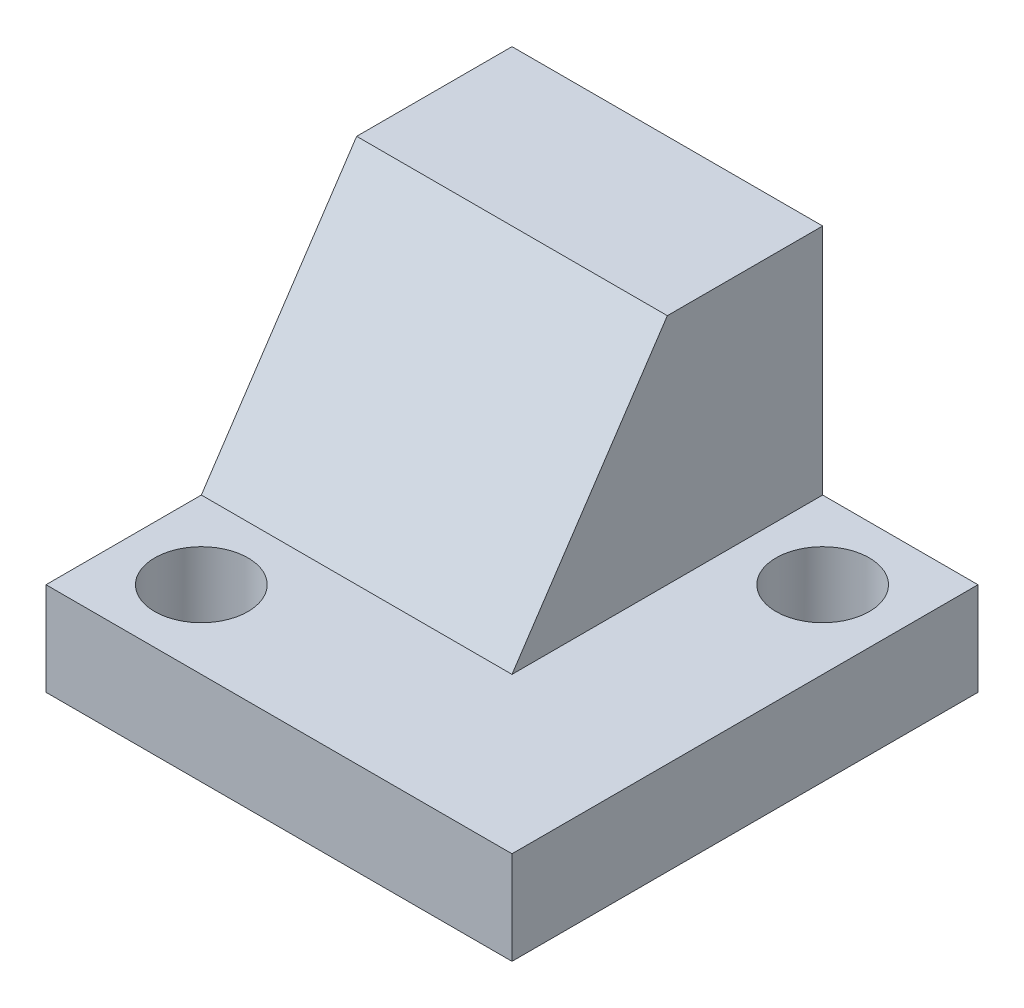
ISO-10303-21;
HEADER;
FILE_DESCRIPTION(('STEP AP214'),'2;1');
FILE_NAME('part.step','',(''),(''),'','','');
FILE_SCHEMA(('AUTOMOTIVE_DESIGN { 1 0 10303 214 1 1 1 1 }'));
ENDSEC;
DATA;
#1=APPLICATION_CONTEXT('core data for automotive mechanical design processes');
#2=APPLICATION_PROTOCOL_DEFINITION('international standard','automotive_design',2000,#1);
#3=PRODUCT_CONTEXT('',#1,'mechanical');
#4=PRODUCT('Part','Part','',(#3));
#5=PRODUCT_RELATED_PRODUCT_CATEGORY('part','',(#4));
#6=PRODUCT_DEFINITION_FORMATION('','',#4);
#7=PRODUCT_DEFINITION_CONTEXT('part definition',#1,'design');
#8=PRODUCT_DEFINITION('design','',#6,#7);
#9=PRODUCT_DEFINITION_SHAPE('','',#8);
#10=(LENGTH_UNIT() NAMED_UNIT(*) SI_UNIT(.MILLI.,.METRE.));
#11=(NAMED_UNIT(*) PLANE_ANGLE_UNIT() SI_UNIT($,.RADIAN.));
#12=(NAMED_UNIT(*) SI_UNIT($,.STERADIAN.) SOLID_ANGLE_UNIT());
#13=UNCERTAINTY_MEASURE_WITH_UNIT(LENGTH_MEASURE(1.E-05),#10,'distance_accuracy_value','');
#14=(GEOMETRIC_REPRESENTATION_CONTEXT(3) GLOBAL_UNCERTAINTY_ASSIGNED_CONTEXT((#13)) GLOBAL_UNIT_ASSIGNED_CONTEXT((#10,
#11,#12)) REPRESENTATION_CONTEXT('',''));
#15=CARTESIAN_POINT('',(0.,0.,0.));
#16=DIRECTION('',(0.,0.,1.));
#17=DIRECTION('',(1.,0.,0.));
#18=AXIS2_PLACEMENT_3D('',#15,#16,#17);
#19=CARTESIAN_POINT('',(0.,7.62,0.));
#20=DIRECTION('',(0.,-1.,0.));
#21=DIRECTION('',(0.,0.,-1.));
#22=AXIS2_PLACEMENT_3D('',#19,#20,#21);
#23=PLANE('',#22);
#24=CARTESIAN_POINT('',(12.7,7.62,-12.7));
#25=DIRECTION('',(0.,1.,0.));
#26=DIRECTION('',(0.,0.,1.));
#27=AXIS2_PLACEMENT_3D('',#24,#25,#26);
#28=CIRCLE('',#27,3.81);
#29=CARTESIAN_POINT('',(12.7,7.62,-8.89));
#30=VERTEX_POINT('',#29);
#31=EDGE_CURVE('E174',#30,#30,#28,.T.);
#32=ORIENTED_EDGE('',*,*,#31,.F.);
#33=EDGE_LOOP('',(#32));
#34=FACE_BOUND('',#33,.T.);
#35=CARTESIAN_POINT('',(-12.7,7.62,12.7));
#36=DIRECTION('',(0.,1.,0.));
#37=DIRECTION('',(0.,0.,1.));
#38=AXIS2_PLACEMENT_3D('',#35,#36,#37);
#39=CIRCLE('',#38,3.81);
#40=CARTESIAN_POINT('',(-12.7,7.62,16.51));
#41=VERTEX_POINT('',#40);
#42=EDGE_CURVE('E303',#41,#41,#39,.T.);
#43=ORIENTED_EDGE('',*,*,#42,.F.);
#44=EDGE_LOOP('',(#43));
#45=FACE_BOUND('',#44,.T.);
#46=DIRECTION('',(0.,0.,-1.));
#47=VECTOR('',#46,1.);
#48=CARTESIAN_POINT('',(6.34999999999999,7.62,6.34999999999999));
#49=LINE('',#48,#47);
#50=CARTESIAN_POINT('',(6.34999999999999,7.62000000000001,6.35));
#51=VERTEX_POINT('',#50);
#52=CARTESIAN_POINT('',(6.34999999999998,7.62,-19.05));
#53=VERTEX_POINT('',#52);
#54=EDGE_CURVE('E158',#51,#53,#49,.T.);
#55=ORIENTED_EDGE('',*,*,#54,.F.);
#56=DIRECTION('',(1.,0.,0.));
#57=VECTOR('',#56,1.);
#58=CARTESIAN_POINT('',(6.34999999999999,7.62,6.34999999999999));
#59=LINE('',#58,#57);
#60=CARTESIAN_POINT('',(-19.05,7.62000000000001,6.35));
#61=VERTEX_POINT('',#60);
#62=EDGE_CURVE('E164',#61,#51,#59,.T.);
#63=ORIENTED_EDGE('',*,*,#62,.F.);
#64=DIRECTION('',(0.,0.,1.));
#65=VECTOR('',#64,1.);
#66=CARTESIAN_POINT('',(-19.05,7.62,19.05));
#67=LINE('',#66,#65);
#68=CARTESIAN_POINT('',(-19.05,7.62,19.05));
#69=VERTEX_POINT('',#68);
#70=EDGE_CURVE('E149',#61,#69,#67,.T.);
#71=ORIENTED_EDGE('',*,*,#70,.T.);
#72=DIRECTION('',(1.,0.,0.));
#73=VECTOR('',#72,1.);
#74=CARTESIAN_POINT('',(-19.05,7.62,19.05));
#75=LINE('',#74,#73);
#76=CARTESIAN_POINT('',(19.05,7.62,19.05));
#77=VERTEX_POINT('',#76);
#78=EDGE_CURVE('E190',#69,#77,#75,.T.);
#79=ORIENTED_EDGE('',*,*,#78,.T.);
#80=DIRECTION('',(0.,0.,-1.));
#81=VECTOR('',#80,1.);
#82=CARTESIAN_POINT('',(19.05,7.62,19.05));
#83=LINE('',#82,#81);
#84=CARTESIAN_POINT('',(19.05,7.62,-19.05));
#85=VERTEX_POINT('',#84);
#86=EDGE_CURVE('E180',#77,#85,#83,.T.);
#87=ORIENTED_EDGE('',*,*,#86,.T.);
#88=DIRECTION('',(-1.,0.,0.));
#89=VECTOR('',#88,1.);
#90=CARTESIAN_POINT('',(-19.05,7.62,-19.05));
#91=LINE('',#90,#89);
#92=EDGE_CURVE('E184',#85,#53,#91,.T.);
#93=ORIENTED_EDGE('',*,*,#92,.T.);
#94=EDGE_LOOP('',(#55,#63,#71,#79,#87,#93));
#95=FACE_BOUND('',#94,.T.);
#96=ADVANCED_FACE('F39',(#34,#45,#95),#23,.F.);
#97=CARTESIAN_POINT('',(19.05,7.62,19.05));
#98=DIRECTION('',(-1.,0.,0.));
#99=DIRECTION('',(0.,0.,1.));
#100=AXIS2_PLACEMENT_3D('',#97,#98,#99);
#101=PLANE('',#100);
#102=DIRECTION('',(0.,0.,-1.));
#103=VECTOR('',#102,1.);
#104=CARTESIAN_POINT('',(19.05,0.,19.05));
#105=LINE('',#104,#103);
#106=CARTESIAN_POINT('',(19.05,0.,19.05));
#107=VERTEX_POINT('',#106);
#108=CARTESIAN_POINT('',(19.05,0.,-19.05));
#109=VERTEX_POINT('',#108);
#110=EDGE_CURVE('E179',#107,#109,#105,.T.);
#111=ORIENTED_EDGE('',*,*,#110,.T.);
#112=DIRECTION('',(0.,-1.,0.));
#113=VECTOR('',#112,1.);
#114=CARTESIAN_POINT('',(19.05,7.62,-19.05));
#115=LINE('',#114,#113);
#116=EDGE_CURVE('E11',#85,#109,#115,.T.);
#117=ORIENTED_EDGE('',*,*,#116,.F.);
#118=ORIENTED_EDGE('',*,*,#86,.F.);
#119=DIRECTION('',(0.,-1.,0.));
#120=VECTOR('',#119,1.);
#121=CARTESIAN_POINT('',(19.05,7.62,19.05));
#122=LINE('',#121,#120);
#123=EDGE_CURVE('E193',#77,#107,#122,.T.);
#124=ORIENTED_EDGE('',*,*,#123,.T.);
#125=EDGE_LOOP('',(#111,#117,#118,#124));
#126=FACE_BOUND('',#125,.T.);
#127=ADVANCED_FACE('F41',(#126),#101,.F.);
#128=CARTESIAN_POINT('',(-19.05,7.62,-19.05));
#129=DIRECTION('',(0.,0.,1.));
#130=DIRECTION('',(1.,0.,0.));
#131=AXIS2_PLACEMENT_3D('',#128,#129,#130);
#132=PLANE('',#131);
#133=DIRECTION('',(-1.,0.,0.));
#134=VECTOR('',#133,1.);
#135=CARTESIAN_POINT('',(-19.05,0.,-19.05));
#136=LINE('',#135,#134);
#137=CARTESIAN_POINT('',(-19.05,0.,-19.05));
#138=VERTEX_POINT('',#137);
#139=EDGE_CURVE('E197',#109,#138,#136,.T.);
#140=ORIENTED_EDGE('',*,*,#139,.T.);
#141=DIRECTION('',(0.,-1.,0.));
#142=VECTOR('',#141,1.);
#143=CARTESIAN_POINT('',(-19.05,7.62,-19.05));
#144=LINE('',#143,#142);
#145=CARTESIAN_POINT('',(-19.05,26.67,-19.05));
#146=VERTEX_POINT('',#145);
#147=EDGE_CURVE('E48',#146,#138,#144,.T.);
#148=ORIENTED_EDGE('',*,*,#147,.F.);
#149=DIRECTION('',(-1.,0.,0.));
#150=VECTOR('',#149,1.);
#151=CARTESIAN_POINT('',(6.34999999999999,26.67,-19.05));
#152=LINE('',#151,#150);
#153=CARTESIAN_POINT('',(6.34999999999999,26.67,-19.05));
#154=VERTEX_POINT('',#153);
#155=EDGE_CURVE('E155',#154,#146,#152,.T.);
#156=ORIENTED_EDGE('',*,*,#155,.F.);
#157=DIRECTION('',(0.,-1.,0.));
#158=VECTOR('',#157,1.);
#159=CARTESIAN_POINT('',(6.34999999999999,26.67,-19.05));
#160=LINE('',#159,#158);
#161=EDGE_CURVE('E172',#154,#53,#160,.T.);
#162=ORIENTED_EDGE('',*,*,#161,.T.);
#163=ORIENTED_EDGE('',*,*,#92,.F.);
#164=ORIENTED_EDGE('',*,*,#116,.T.);
#165=EDGE_LOOP('',(#140,#148,#156,#162,#163,#164));
#166=FACE_BOUND('',#165,.T.);
#167=ADVANCED_FACE('F331',(#166),#132,.F.);
#168=CARTESIAN_POINT('',(-19.05,7.62,19.05));
#169=DIRECTION('',(1.,0.,0.));
#170=DIRECTION('',(0.,0.,-1.));
#171=AXIS2_PLACEMENT_3D('',#168,#169,#170);
#172=PLANE('',#171);
#173=DIRECTION('',(0.,0.,1.));
#174=VECTOR('',#173,1.);
#175=CARTESIAN_POINT('',(-19.05,7.62,0.635));
#176=LINE('',#175,#174);
#177=CARTESIAN_POINT('',(-19.05,7.62,-13.335));
#178=VERTEX_POINT('',#177);
#179=CARTESIAN_POINT('',(-19.05,7.62,0.635));
#180=VERTEX_POINT('',#179);
#181=EDGE_CURVE('E233',#178,#180,#176,.T.);
#182=ORIENTED_EDGE('',*,*,#181,.F.);
#183=DIRECTION('',(0.,-1.,0.));
#184=VECTOR('',#183,1.);
#185=CARTESIAN_POINT('',(-19.05,7.62,-13.335));
#186=LINE('',#185,#184);
#187=CARTESIAN_POINT('',(-19.05,21.59,-13.335));
#188=VERTEX_POINT('',#187);
#189=EDGE_CURVE('E63',#188,#178,#186,.T.);
#190=ORIENTED_EDGE('',*,*,#189,.F.);
#191=DIRECTION('',(0.,0.,-1.));
#192=VECTOR('',#191,1.);
#193=CARTESIAN_POINT('',(-19.05,21.59,-13.335));
#194=LINE('',#193,#192);
#195=CARTESIAN_POINT('',(-19.05,21.59,-10.541));
#196=VERTEX_POINT('',#195);
#197=EDGE_CURVE('E241',#196,#188,#194,.T.);
#198=ORIENTED_EDGE('',*,*,#197,.F.);
#199=DIRECTION('',(0.,1.,0.));
#200=VECTOR('',#199,1.);
#201=CARTESIAN_POINT('',(-19.05,21.59,-10.541));
#202=LINE('',#201,#200);
#203=CARTESIAN_POINT('',(-19.05,10.414,-10.541));
#204=VERTEX_POINT('',#203);
#205=EDGE_CURVE('E273',#204,#196,#202,.T.);
#206=ORIENTED_EDGE('',*,*,#205,.F.);
#207=DIRECTION('',(0.,0.,-1.));
#208=VECTOR('',#207,1.);
#209=CARTESIAN_POINT('',(-19.05,10.414,-10.541));
#210=LINE('',#209,#208);
#211=CARTESIAN_POINT('',(-19.05,10.414,0.635));
#212=VERTEX_POINT('',#211);
#213=EDGE_CURVE('E269',#212,#204,#210,.T.);
#214=ORIENTED_EDGE('',*,*,#213,.F.);
#215=DIRECTION('',(0.,1.,0.));
#216=VECTOR('',#215,1.);
#217=CARTESIAN_POINT('',(-19.05,10.414,0.635));
#218=LINE('',#217,#216);
#219=EDGE_CURVE('E265',#180,#212,#218,.T.);
#220=ORIENTED_EDGE('',*,*,#219,.F.);
#221=EDGE_LOOP('',(#182,#190,#198,#206,#214,#220));
#222=FACE_BOUND('',#221,.T.);
#223=ORIENTED_EDGE('',*,*,#70,.F.);
#224=DIRECTION('',(0.,-0.832050294337844,0.554700196225229));
#225=VECTOR('',#224,1.);
#226=CARTESIAN_POINT('',(-19.05,26.67,-6.35));
#227=LINE('',#226,#225);
#228=CARTESIAN_POINT('',(-19.05,26.67,-6.35));
#229=VERTEX_POINT('',#228);
#230=EDGE_CURVE('E135',#229,#61,#227,.T.);
#231=ORIENTED_EDGE('',*,*,#230,.F.);
#232=DIRECTION('',(0.,0.,1.));
#233=VECTOR('',#232,1.);
#234=CARTESIAN_POINT('',(-19.05,26.67,6.35));
#235=LINE('',#234,#233);
#236=EDGE_CURVE('E147',#146,#229,#235,.T.);
#237=ORIENTED_EDGE('',*,*,#236,.F.);
#238=ORIENTED_EDGE('',*,*,#147,.T.);
#239=DIRECTION('',(0.,0.,1.));
#240=VECTOR('',#239,1.);
#241=CARTESIAN_POINT('',(-19.05,0.,19.05));
#242=LINE('',#241,#240);
#243=CARTESIAN_POINT('',(-19.05,0.,19.05));
#244=VERTEX_POINT('',#243);
#245=EDGE_CURVE('E200',#138,#244,#242,.T.);
#246=ORIENTED_EDGE('',*,*,#245,.T.);
#247=DIRECTION('',(0.,-1.,0.));
#248=VECTOR('',#247,1.);
#249=CARTESIAN_POINT('',(-19.05,7.62,19.05));
#250=LINE('',#249,#248);
#251=EDGE_CURVE('E208',#69,#244,#250,.T.);
#252=ORIENTED_EDGE('',*,*,#251,.F.);
#253=EDGE_LOOP('',(#223,#231,#237,#238,#246,#252));
#254=FACE_BOUND('',#253,.T.);
#255=ADVANCED_FACE('F145',(#222,#254),#172,.F.);
#256=CARTESIAN_POINT('',(-19.05,7.62,19.05));
#257=DIRECTION('',(0.,0.,-1.));
#258=DIRECTION('',(-1.,0.,0.));
#259=AXIS2_PLACEMENT_3D('',#256,#257,#258);
#260=PLANE('',#259);
#261=DIRECTION('',(1.,0.,0.));
#262=VECTOR('',#261,1.);
#263=CARTESIAN_POINT('',(-19.05,0.,19.05));
#264=LINE('',#263,#262);
#265=EDGE_CURVE('E185',#244,#107,#264,.T.);
#266=ORIENTED_EDGE('',*,*,#265,.T.);
#267=ORIENTED_EDGE('',*,*,#123,.F.);
#268=ORIENTED_EDGE('',*,*,#78,.F.);
#269=ORIENTED_EDGE('',*,*,#251,.T.);
#270=EDGE_LOOP('',(#266,#267,#268,#269));
#271=FACE_BOUND('',#270,.T.);
#272=ADVANCED_FACE('F220',(#271),#260,.F.);
#273=CARTESIAN_POINT('',(0.,0.,0.));
#274=DIRECTION('',(0.,-1.,0.));
#275=DIRECTION('',(0.,0.,-1.));
#276=AXIS2_PLACEMENT_3D('',#273,#274,#275);
#277=PLANE('',#276);
#278=CARTESIAN_POINT('',(12.7,0.,-12.7));
#279=DIRECTION('',(0.,-1.,0.));
#280=DIRECTION('',(0.,0.,-1.));
#281=AXIS2_PLACEMENT_3D('',#278,#279,#280);
#282=CIRCLE('',#281,3.81);
#283=CARTESIAN_POINT('',(12.7,0.,-16.51));
#284=VERTEX_POINT('',#283);
#285=EDGE_CURVE('E300',#284,#284,#282,.F.);
#286=ORIENTED_EDGE('',*,*,#285,.T.);
#287=EDGE_LOOP('',(#286));
#288=FACE_BOUND('',#287,.T.);
#289=CARTESIAN_POINT('',(-12.7,0.,12.7));
#290=DIRECTION('',(0.,-1.,0.));
#291=DIRECTION('',(0.,0.,-1.));
#292=AXIS2_PLACEMENT_3D('',#289,#290,#291);
#293=CIRCLE('',#292,3.81);
#294=CARTESIAN_POINT('',(-12.7,0.,8.89));
#295=VERTEX_POINT('',#294);
#296=EDGE_CURVE('E167',#295,#295,#293,.F.);
#297=ORIENTED_EDGE('',*,*,#296,.T.);
#298=EDGE_LOOP('',(#297));
#299=FACE_BOUND('',#298,.T.);
#300=ORIENTED_EDGE('',*,*,#110,.F.);
#301=ORIENTED_EDGE('',*,*,#265,.F.);
#302=ORIENTED_EDGE('',*,*,#245,.F.);
#303=ORIENTED_EDGE('',*,*,#139,.F.);
#304=EDGE_LOOP('',(#300,#301,#302,#303));
#305=FACE_BOUND('',#304,.T.);
#306=ADVANCED_FACE('F217',(#288,#299,#305),#277,.T.);
#307=CARTESIAN_POINT('',(6.34999999999999,26.67,6.34999999999999));
#308=DIRECTION('',(-1.,0.,0.));
#309=DIRECTION('',(0.,0.,1.));
#310=AXIS2_PLACEMENT_3D('',#307,#308,#309);
#311=PLANE('',#310);
#312=DIRECTION('',(0.,0.,-1.));
#313=VECTOR('',#312,1.);
#314=CARTESIAN_POINT('',(6.34999999999999,26.67,6.34999999999999));
#315=LINE('',#314,#313);
#316=CARTESIAN_POINT('',(6.34999999999999,26.67,-6.35));
#317=VERTEX_POINT('',#316);
#318=EDGE_CURVE('E157',#317,#154,#315,.T.);
#319=ORIENTED_EDGE('',*,*,#318,.F.);
#320=DIRECTION('',(0.,0.832050294337844,-0.554700196225229));
#321=VECTOR('',#320,1.);
#322=CARTESIAN_POINT('',(6.34999999999999,26.67,-6.35));
#323=LINE('',#322,#321);
#324=EDGE_CURVE('E55',#51,#317,#323,.T.);
#325=ORIENTED_EDGE('',*,*,#324,.F.);
#326=ORIENTED_EDGE('',*,*,#54,.T.);
#327=ORIENTED_EDGE('',*,*,#161,.F.);
#328=EDGE_LOOP('',(#319,#325,#326,#327));
#329=FACE_BOUND('',#328,.T.);
#330=ADVANCED_FACE('F228',(#329),#311,.F.);
#331=CARTESIAN_POINT('',(0.,26.67,0.));
#332=DIRECTION('',(0.,1.,0.));
#333=DIRECTION('',(0.,0.,1.));
#334=AXIS2_PLACEMENT_3D('',#331,#332,#333);
#335=PLANE('',#334);
#336=DIRECTION('',(-1.,0.,0.));
#337=VECTOR('',#336,1.);
#338=CARTESIAN_POINT('',(19.051,26.67,-6.35));
#339=LINE('',#338,#337);
#340=EDGE_CURVE('E132',#317,#229,#339,.T.);
#341=ORIENTED_EDGE('',*,*,#340,.F.);
#342=ORIENTED_EDGE('',*,*,#318,.T.);
#343=ORIENTED_EDGE('',*,*,#155,.T.);
#344=ORIENTED_EDGE('',*,*,#236,.T.);
#345=EDGE_LOOP('',(#341,#342,#343,#344));
#346=FACE_BOUND('',#345,.T.);
#347=ADVANCED_FACE('F153',(#346),#335,.T.);
#348=CARTESIAN_POINT('',(-12.7,-0.00100000000000013,12.7));
#349=DIRECTION('',(0.,1.,0.));
#350=DIRECTION('',(0.,0.,1.));
#351=AXIS2_PLACEMENT_3D('',#348,#349,#350);
#352=CYLINDRICAL_SURFACE('',#351,3.81);
#353=ORIENTED_EDGE('',*,*,#296,.F.);
#354=EDGE_LOOP('',(#353));
#355=FACE_BOUND('',#354,.T.);
#356=ORIENTED_EDGE('',*,*,#42,.T.);
#357=EDGE_LOOP('',(#356));
#358=FACE_BOUND('',#357,.T.);
#359=ADVANCED_FACE('F313',(#355,#358),#352,.F.);
#360=CARTESIAN_POINT('',(12.7,-0.00100000000000013,-12.7));
#361=DIRECTION('',(0.,1.,0.));
#362=DIRECTION('',(0.,0.,1.));
#363=AXIS2_PLACEMENT_3D('',#360,#361,#362);
#364=CYLINDRICAL_SURFACE('',#363,3.81);
#365=ORIENTED_EDGE('',*,*,#285,.F.);
#366=EDGE_LOOP('',(#365));
#367=FACE_BOUND('',#366,.T.);
#368=ORIENTED_EDGE('',*,*,#31,.T.);
#369=EDGE_LOOP('',(#368));
#370=FACE_BOUND('',#369,.T.);
#371=ADVANCED_FACE('F315',(#367,#370),#364,.F.);
#372=CARTESIAN_POINT('',(-12.7,7.62,-13.335));
#373=DIRECTION('',(0.,0.,-1.));
#374=DIRECTION('',(-1.,0.,0.));
#375=AXIS2_PLACEMENT_3D('',#372,#373,#374);
#376=PLANE('',#375);
#377=ORIENTED_EDGE('',*,*,#189,.T.);
#378=DIRECTION('',(-1.,0.,0.));
#379=VECTOR('',#378,1.);
#380=CARTESIAN_POINT('',(-12.7,7.62,-13.335));
#381=LINE('',#380,#379);
#382=CARTESIAN_POINT('',(-12.7,7.62,-13.335));
#383=VERTEX_POINT('',#382);
#384=EDGE_CURVE('E260',#383,#178,#381,.T.);
#385=ORIENTED_EDGE('',*,*,#384,.F.);
#386=DIRECTION('',(0.,-1.,0.));
#387=VECTOR('',#386,1.);
#388=CARTESIAN_POINT('',(-12.7,7.62,-13.335));
#389=LINE('',#388,#387);
#390=CARTESIAN_POINT('',(-12.7,21.59,-13.335));
#391=VERTEX_POINT('',#390);
#392=EDGE_CURVE('E236',#391,#383,#389,.T.);
#393=ORIENTED_EDGE('',*,*,#392,.F.);
#394=DIRECTION('',(-1.,0.,0.));
#395=VECTOR('',#394,1.);
#396=CARTESIAN_POINT('',(-12.7,21.59,-13.335));
#397=LINE('',#396,#395);
#398=EDGE_CURVE('E280',#391,#188,#397,.T.);
#399=ORIENTED_EDGE('',*,*,#398,.T.);
#400=EDGE_LOOP('',(#377,#385,#393,#399));
#401=FACE_BOUND('',#400,.T.);
#402=ADVANCED_FACE('F321',(#401),#376,.F.);
#403=CARTESIAN_POINT('',(-12.7,21.59,-13.335));
#404=DIRECTION('',(0.,1.,0.));
#405=DIRECTION('',(0.,0.,1.));
#406=AXIS2_PLACEMENT_3D('',#403,#404,#405);
#407=PLANE('',#406);
#408=ORIENTED_EDGE('',*,*,#197,.T.);
#409=ORIENTED_EDGE('',*,*,#398,.F.);
#410=DIRECTION('',(0.,0.,-1.));
#411=VECTOR('',#410,1.);
#412=CARTESIAN_POINT('',(-12.7,21.59,-13.335));
#413=LINE('',#412,#411);
#414=CARTESIAN_POINT('',(-12.7,21.59,-10.541));
#415=VERTEX_POINT('',#414);
#416=EDGE_CURVE('E257',#415,#391,#413,.T.);
#417=ORIENTED_EDGE('',*,*,#416,.F.);
#418=DIRECTION('',(-1.,0.,0.));
#419=VECTOR('',#418,1.);
#420=CARTESIAN_POINT('',(-12.7,21.59,-10.541));
#421=LINE('',#420,#419);
#422=EDGE_CURVE('E283',#415,#196,#421,.T.);
#423=ORIENTED_EDGE('',*,*,#422,.T.);
#424=EDGE_LOOP('',(#408,#409,#417,#423));
#425=FACE_BOUND('',#424,.T.);
#426=ADVANCED_FACE('F419',(#425),#407,.F.);
#427=CARTESIAN_POINT('',(-12.7,21.59,-10.541));
#428=DIRECTION('',(0.,0.,1.));
#429=DIRECTION('',(1.,0.,0.));
#430=AXIS2_PLACEMENT_3D('',#427,#428,#429);
#431=PLANE('',#430);
#432=ORIENTED_EDGE('',*,*,#205,.T.);
#433=ORIENTED_EDGE('',*,*,#422,.F.);
#434=DIRECTION('',(0.,1.,0.));
#435=VECTOR('',#434,1.);
#436=CARTESIAN_POINT('',(-12.7,21.59,-10.541));
#437=LINE('',#436,#435);
#438=CARTESIAN_POINT('',(-12.7,10.414,-10.541));
#439=VERTEX_POINT('',#438);
#440=EDGE_CURVE('E253',#439,#415,#437,.T.);
#441=ORIENTED_EDGE('',*,*,#440,.F.);
#442=DIRECTION('',(-1.,0.,0.));
#443=VECTOR('',#442,1.);
#444=CARTESIAN_POINT('',(-12.7,10.414,-10.541));
#445=LINE('',#444,#443);
#446=EDGE_CURVE('E286',#439,#204,#445,.T.);
#447=ORIENTED_EDGE('',*,*,#446,.T.);
#448=EDGE_LOOP('',(#432,#433,#441,#447));
#449=FACE_BOUND('',#448,.T.);
#450=ADVANCED_FACE('F411',(#449),#431,.F.);
#451=CARTESIAN_POINT('',(-12.7,10.414,-10.541));
#452=DIRECTION('',(0.,1.,0.));
#453=DIRECTION('',(0.,0.,1.));
#454=AXIS2_PLACEMENT_3D('',#451,#452,#453);
#455=PLANE('',#454);
#456=ORIENTED_EDGE('',*,*,#213,.T.);
#457=ORIENTED_EDGE('',*,*,#446,.F.);
#458=DIRECTION('',(0.,0.,-1.));
#459=VECTOR('',#458,1.);
#460=CARTESIAN_POINT('',(-12.7,10.414,-10.541));
#461=LINE('',#460,#459);
#462=CARTESIAN_POINT('',(-12.7,10.414,0.635));
#463=VERTEX_POINT('',#462);
#464=EDGE_CURVE('E249',#463,#439,#461,.T.);
#465=ORIENTED_EDGE('',*,*,#464,.F.);
#466=DIRECTION('',(-1.,0.,0.));
#467=VECTOR('',#466,1.);
#468=CARTESIAN_POINT('',(-12.7,10.414,0.635));
#469=LINE('',#468,#467);
#470=EDGE_CURVE('E289',#463,#212,#469,.T.);
#471=ORIENTED_EDGE('',*,*,#470,.T.);
#472=EDGE_LOOP('',(#456,#457,#465,#471));
#473=FACE_BOUND('',#472,.T.);
#474=ADVANCED_FACE('F403',(#473),#455,.F.);
#475=CARTESIAN_POINT('',(-12.7,10.414,0.635));
#476=DIRECTION('',(0.,0.,1.));
#477=DIRECTION('',(1.,0.,0.));
#478=AXIS2_PLACEMENT_3D('',#475,#476,#477);
#479=PLANE('',#478);
#480=ORIENTED_EDGE('',*,*,#219,.T.);
#481=ORIENTED_EDGE('',*,*,#470,.F.);
#482=DIRECTION('',(0.,1.,0.));
#483=VECTOR('',#482,1.);
#484=CARTESIAN_POINT('',(-12.7,10.414,0.635));
#485=LINE('',#484,#483);
#486=CARTESIAN_POINT('',(-12.7,7.62,0.635));
#487=VERTEX_POINT('',#486);
#488=EDGE_CURVE('E245',#487,#463,#485,.T.);
#489=ORIENTED_EDGE('',*,*,#488,.F.);
#490=DIRECTION('',(-1.,0.,0.));
#491=VECTOR('',#490,1.);
#492=CARTESIAN_POINT('',(-12.7,7.62,0.635));
#493=LINE('',#492,#491);
#494=EDGE_CURVE('E292',#487,#180,#493,.T.);
#495=ORIENTED_EDGE('',*,*,#494,.T.);
#496=EDGE_LOOP('',(#480,#481,#489,#495));
#497=FACE_BOUND('',#496,.T.);
#498=ADVANCED_FACE('F395',(#497),#479,.F.);
#499=CARTESIAN_POINT('',(-12.7,7.62,0.635));
#500=DIRECTION('',(0.,-1.,0.));
#501=DIRECTION('',(0.,0.,-1.));
#502=AXIS2_PLACEMENT_3D('',#499,#500,#501);
#503=PLANE('',#502);
#504=ORIENTED_EDGE('',*,*,#181,.T.);
#505=ORIENTED_EDGE('',*,*,#494,.F.);
#506=DIRECTION('',(0.,0.,1.));
#507=VECTOR('',#506,1.);
#508=CARTESIAN_POINT('',(-12.7,7.62,0.635));
#509=LINE('',#508,#507);
#510=EDGE_CURVE('E240',#383,#487,#509,.T.);
#511=ORIENTED_EDGE('',*,*,#510,.F.);
#512=ORIENTED_EDGE('',*,*,#384,.T.);
#513=EDGE_LOOP('',(#504,#505,#511,#512));
#514=FACE_BOUND('',#513,.T.);
#515=ADVANCED_FACE('F388',(#514),#503,.F.);
#516=CARTESIAN_POINT('',(-12.7,0.,0.));
#517=DIRECTION('',(1.,0.,0.));
#518=DIRECTION('',(0.,0.,-1.));
#519=AXIS2_PLACEMENT_3D('',#516,#517,#518);
#520=PLANE('',#519);
#521=ORIENTED_EDGE('',*,*,#392,.T.);
#522=ORIENTED_EDGE('',*,*,#510,.T.);
#523=ORIENTED_EDGE('',*,*,#488,.T.);
#524=ORIENTED_EDGE('',*,*,#464,.T.);
#525=ORIENTED_EDGE('',*,*,#440,.T.);
#526=ORIENTED_EDGE('',*,*,#416,.T.);
#527=EDGE_LOOP('',(#521,#522,#523,#524,#525,#526));
#528=FACE_BOUND('',#527,.T.);
#529=ADVANCED_FACE('F378',(#528),#520,.F.);
#530=CARTESIAN_POINT('',(19.051,26.67,-6.35));
#531=DIRECTION('',(0.,-0.554700196225229,-0.832050294337844));
#532=DIRECTION('',(0.,0.832050294337844,-0.554700196225229));
#533=AXIS2_PLACEMENT_3D('',#530,#531,#532);
#534=PLANE('',#533);
#535=ORIENTED_EDGE('',*,*,#324,.T.);
#536=ORIENTED_EDGE('',*,*,#340,.T.);
#537=ORIENTED_EDGE('',*,*,#230,.T.);
#538=ORIENTED_EDGE('',*,*,#62,.T.);
#539=EDGE_LOOP('',(#535,#536,#537,#538));
#540=FACE_BOUND('',#539,.T.);
#541=ADVANCED_FACE('F134',(#540),#534,.F.);
#542=CLOSED_SHELL('',(#96,#127,#167,#255,#272,#306,#330,#347,#359,#371,#402,#426,#450,#474,#498,
#515,#529,#541));
#543=MANIFOLD_SOLID_BREP('B2',#542);
#544=ADVANCED_BREP_SHAPE_REPRESENTATION('',(#18,#543),#14);
#545=SHAPE_DEFINITION_REPRESENTATION(#9,#544);
ENDSEC;
END-ISO-10303-21;
